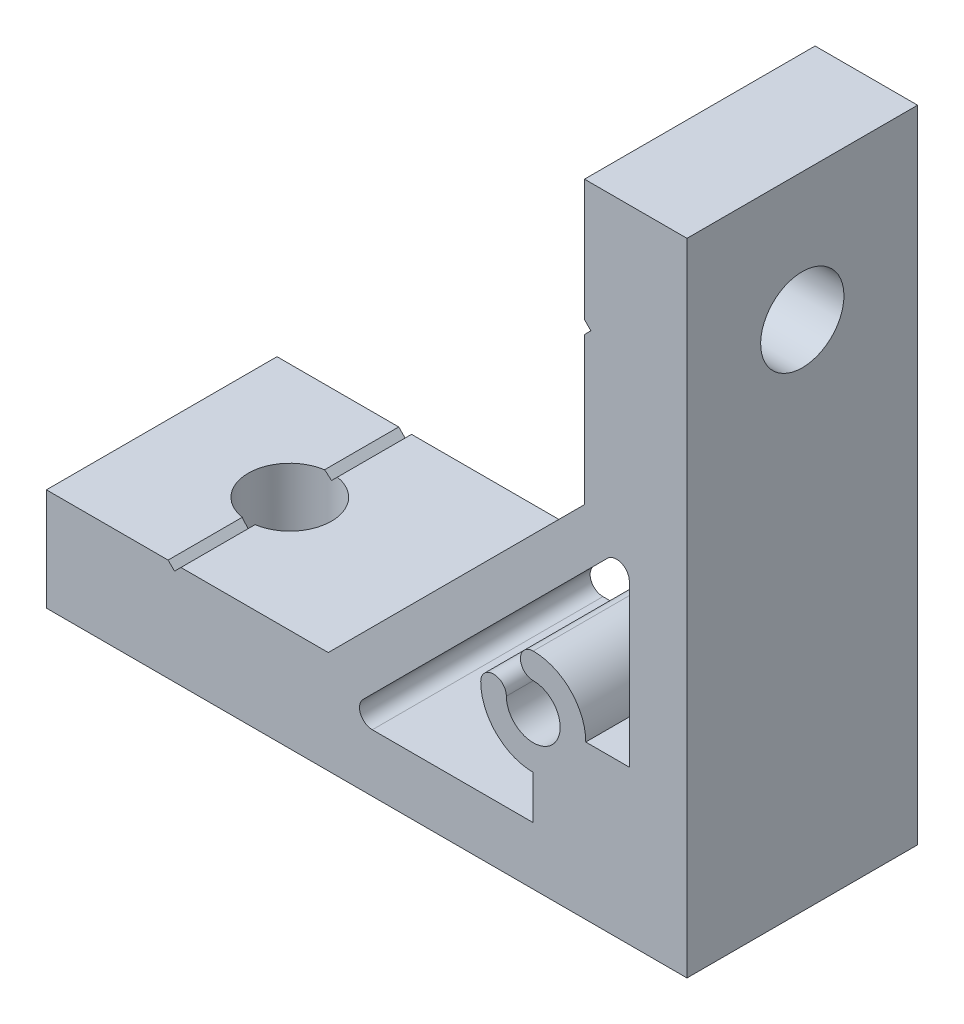
ISO-10303-21;
HEADER;
FILE_DESCRIPTION(('STEP AP214'),'2;1');
FILE_NAME('part.step','',(''),(''),'','','');
FILE_SCHEMA(('AUTOMOTIVE_DESIGN { 1 0 10303 214 1 1 1 1 }'));
ENDSEC;
DATA;
#1=APPLICATION_CONTEXT('core data for automotive mechanical design processes');
#2=APPLICATION_PROTOCOL_DEFINITION('international standard','automotive_design',2000,#1);
#3=PRODUCT_CONTEXT('',#1,'mechanical');
#4=PRODUCT('Part','Part','',(#3));
#5=PRODUCT_RELATED_PRODUCT_CATEGORY('part','',(#4));
#6=PRODUCT_DEFINITION_FORMATION('','',#4);
#7=PRODUCT_DEFINITION_CONTEXT('part definition',#1,'design');
#8=PRODUCT_DEFINITION('design','',#6,#7);
#9=PRODUCT_DEFINITION_SHAPE('','',#8);
#10=(LENGTH_UNIT() NAMED_UNIT(*) SI_UNIT(.MILLI.,.METRE.));
#11=(NAMED_UNIT(*) PLANE_ANGLE_UNIT() SI_UNIT($,.RADIAN.));
#12=(NAMED_UNIT(*) SI_UNIT($,.STERADIAN.) SOLID_ANGLE_UNIT());
#13=UNCERTAINTY_MEASURE_WITH_UNIT(LENGTH_MEASURE(1.E-05),#10,'distance_accuracy_value','');
#14=(GEOMETRIC_REPRESENTATION_CONTEXT(3) GLOBAL_UNCERTAINTY_ASSIGNED_CONTEXT((#13)) GLOBAL_UNIT_ASSIGNED_CONTEXT((#10,
#11,#12)) REPRESENTATION_CONTEXT('',''));
#15=CARTESIAN_POINT('',(0.,0.,0.));
#16=DIRECTION('',(0.,0.,1.));
#17=DIRECTION('',(1.,0.,0.));
#18=AXIS2_PLACEMENT_3D('',#15,#16,#17);
#19=CARTESIAN_POINT('',(-39.5,8.00000000000008,9.));
#20=DIRECTION('',(0.707106781186547,-0.707106781186547,0.));
#21=DIRECTION('',(0.707106781186548,0.707106781186548,0.));
#22=AXIS2_PLACEMENT_3D('',#19,#20,#21);
#23=PLANE('',#22);
#24=DIRECTION('',(0.,0.,-1.));
#25=VECTOR('',#24,1.);
#26=CARTESIAN_POINT('',(-39.5,8.00000000000008,9.));
#27=LINE('',#26,#25);
#28=CARTESIAN_POINT('',(-39.5,8.00000000000008,9.));
#29=VERTEX_POINT('',#28);
#30=CARTESIAN_POINT('',(-39.5,8.00000000000009,3.21130814466628));
#31=VERTEX_POINT('',#30);
#32=EDGE_CURVE('E264',#29,#31,#27,.T.);
#33=ORIENTED_EDGE('',*,*,#32,.T.);
#34=CARTESIAN_POINT('',(-40.,7.50000000000008,0.));
#35=DIRECTION('',(0.707106781186547,-0.707106781186547,0.));
#36=DIRECTION('',(0.707106781186548,0.707106781186548,0.));
#37=AXIS2_PLACEMENT_3D('',#34,#35,#36);
#38=ELLIPSE('',#37,4.59619407771252,3.25);
#39=CARTESIAN_POINT('',(-40.,7.50000000000008,3.25));
#40=VERTEX_POINT('',#39);
#41=EDGE_CURVE('E249',#31,#40,#38,.T.);
#42=ORIENTED_EDGE('',*,*,#41,.T.);
#43=DIRECTION('',(0.,0.,-1.));
#44=VECTOR('',#43,1.);
#45=CARTESIAN_POINT('',(-40.,7.50000000000008,9.));
#46=LINE('',#45,#44);
#47=CARTESIAN_POINT('',(-40.,7.50000000000008,9.));
#48=VERTEX_POINT('',#47);
#49=EDGE_CURVE('E248',#48,#40,#46,.T.);
#50=ORIENTED_EDGE('',*,*,#49,.F.);
#51=DIRECTION('',(-0.707106781186547,-0.707106781186547,0.));
#52=VECTOR('',#51,1.);
#53=CARTESIAN_POINT('',(-39.5,8.00000000000008,9.));
#54=LINE('',#53,#52);
#55=EDGE_CURVE('E365',#29,#48,#54,.T.);
#56=ORIENTED_EDGE('',*,*,#55,.F.);
#57=EDGE_LOOP('',(#33,#42,#50,#56));
#58=FACE_BOUND('',#57,.T.);
#59=ADVANCED_FACE('F34',(#58),#23,.F.);
#60=CARTESIAN_POINT('',(-40.,7.50000000000008,9.));
#61=DIRECTION('',(-0.707106781186549,-0.707106781186546,0.));
#62=DIRECTION('',(0.707106781186546,-0.707106781186549,0.));
#63=AXIS2_PLACEMENT_3D('',#60,#61,#62);
#64=PLANE('',#63);
#65=DIRECTION('',(0.,0.,-1.));
#66=VECTOR('',#65,1.);
#67=CARTESIAN_POINT('',(-40.5,8.00000000000008,9.));
#68=LINE('',#67,#66);
#69=CARTESIAN_POINT('',(-40.5,8.00000000000008,-3.21130814466628));
#70=VERTEX_POINT('',#69);
#71=CARTESIAN_POINT('',(-40.5,8.00000000000008,-9.));
#72=VERTEX_POINT('',#71);
#73=EDGE_CURVE('E256',#70,#72,#68,.T.);
#74=ORIENTED_EDGE('',*,*,#73,.F.);
#75=CARTESIAN_POINT('',(-40.,7.50000000000007,0.));
#76=DIRECTION('',(-0.707106781186549,-0.707106781186546,0.));
#77=DIRECTION('',(-0.707106781186546,0.707106781186549,0.));
#78=AXIS2_PLACEMENT_3D('',#75,#76,#77);
#79=ELLIPSE('',#78,4.59619407771261,3.25);
#80=CARTESIAN_POINT('',(-40.,7.50000000000008,-3.25));
#81=VERTEX_POINT('',#80);
#82=EDGE_CURVE('E49',#70,#81,#79,.T.);
#83=ORIENTED_EDGE('',*,*,#82,.T.);
#84=CARTESIAN_POINT('',(-40.,7.50000000000008,-9.));
#85=VERTEX_POINT('',#84);
#86=EDGE_CURVE('E255',#81,#85,#46,.T.);
#87=ORIENTED_EDGE('',*,*,#86,.T.);
#88=DIRECTION('',(-0.707106781186546,0.707106781186549,0.));
#89=VECTOR('',#88,1.);
#90=CARTESIAN_POINT('',(-40.,7.50000000000008,-9.));
#91=LINE('',#90,#89);
#92=EDGE_CURVE('E332',#85,#72,#91,.T.);
#93=ORIENTED_EDGE('',*,*,#92,.T.);
#94=EDGE_LOOP('',(#74,#83,#87,#93));
#95=FACE_BOUND('',#94,.T.);
#96=ADVANCED_FACE('F414',(#95),#64,.F.);
#97=CARTESIAN_POINT('',(-8.00000000000042,40.5,9.));
#98=DIRECTION('',(0.707106781186549,0.707106781186546,0.));
#99=DIRECTION('',(-0.707106781186546,0.707106781186549,0.));
#100=AXIS2_PLACEMENT_3D('',#97,#98,#99);
#101=PLANE('',#100);
#102=DIRECTION('',(0.,0.,-1.));
#103=VECTOR('',#102,1.);
#104=CARTESIAN_POINT('',(-8.00000000000042,40.5,9.));
#105=LINE('',#104,#103);
#106=CARTESIAN_POINT('',(-8.00000000000042,40.5,9.));
#107=VERTEX_POINT('',#106);
#108=CARTESIAN_POINT('',(-8.00000000000042,40.5,3.21130814466629));
#109=VERTEX_POINT('',#108);
#110=EDGE_CURVE('E282',#107,#109,#105,.T.);
#111=ORIENTED_EDGE('',*,*,#110,.T.);
#112=CARTESIAN_POINT('',(-7.50000000000042,40.,0.));
#113=DIRECTION('',(0.707106781186549,0.707106781186546,0.));
#114=DIRECTION('',(-0.707106781186546,0.707106781186549,0.));
#115=AXIS2_PLACEMENT_3D('',#112,#113,#114);
#116=ELLIPSE('',#115,4.59619407771271,3.25);
#117=CARTESIAN_POINT('',(-7.50000000000042,40.,3.25));
#118=VERTEX_POINT('',#117);
#119=EDGE_CURVE('E452',#109,#118,#116,.T.);
#120=ORIENTED_EDGE('',*,*,#119,.T.);
#121=DIRECTION('',(0.,0.,-1.));
#122=VECTOR('',#121,1.);
#123=CARTESIAN_POINT('',(-7.50000000000042,40.,9.));
#124=LINE('',#123,#122);
#125=CARTESIAN_POINT('',(-7.50000000000042,40.,9.));
#126=VERTEX_POINT('',#125);
#127=EDGE_CURVE('E278',#126,#118,#124,.T.);
#128=ORIENTED_EDGE('',*,*,#127,.F.);
#129=DIRECTION('',(0.707106781186546,-0.707106781186549,0.));
#130=VECTOR('',#129,1.);
#131=CARTESIAN_POINT('',(-8.00000000000042,40.5,9.));
#132=LINE('',#131,#130);
#133=EDGE_CURVE('E355',#107,#126,#132,.T.);
#134=ORIENTED_EDGE('',*,*,#133,.F.);
#135=EDGE_LOOP('',(#111,#120,#128,#134));
#136=FACE_BOUND('',#135,.T.);
#137=ADVANCED_FACE('F421',(#136),#101,.F.);
#138=CARTESIAN_POINT('',(-7.50000000000042,40.,9.));
#139=DIRECTION('',(0.707106781186549,-0.707106781186546,0.));
#140=DIRECTION('',(0.707106781186546,0.707106781186549,0.));
#141=AXIS2_PLACEMENT_3D('',#138,#139,#140);
#142=PLANE('',#141);
#143=DIRECTION('',(0.,0.,-1.));
#144=VECTOR('',#143,1.);
#145=CARTESIAN_POINT('',(-8.00000000000042,39.5,9.));
#146=LINE('',#145,#144);
#147=CARTESIAN_POINT('',(-8.00000000000042,39.5,-3.21130814466628));
#148=VERTEX_POINT('',#147);
#149=CARTESIAN_POINT('',(-8.00000000000042,39.5,-9.));
#150=VERTEX_POINT('',#149);
#151=EDGE_CURVE('E273',#148,#150,#146,.T.);
#152=ORIENTED_EDGE('',*,*,#151,.F.);
#153=CARTESIAN_POINT('',(-7.50000000000043,40.,0.));
#154=DIRECTION('',(0.707106781186549,-0.707106781186546,0.));
#155=DIRECTION('',(-0.707106781186546,-0.707106781186549,0.));
#156=AXIS2_PLACEMENT_3D('',#153,#154,#155);
#157=ELLIPSE('',#156,4.59619407771239,3.25);
#158=CARTESIAN_POINT('',(-7.50000000000042,40.,-3.25));
#159=VERTEX_POINT('',#158);
#160=EDGE_CURVE('E56',#148,#159,#157,.T.);
#161=ORIENTED_EDGE('',*,*,#160,.T.);
#162=CARTESIAN_POINT('',(-7.50000000000042,40.,-9.));
#163=VERTEX_POINT('',#162);
#164=EDGE_CURVE('E277',#159,#163,#124,.T.);
#165=ORIENTED_EDGE('',*,*,#164,.T.);
#166=DIRECTION('',(-0.707106781186546,-0.707106781186549,0.));
#167=VECTOR('',#166,1.);
#168=CARTESIAN_POINT('',(-7.50000000000042,40.,-9.));
#169=LINE('',#168,#167);
#170=EDGE_CURVE('E307',#163,#150,#169,.T.);
#171=ORIENTED_EDGE('',*,*,#170,.T.);
#172=EDGE_LOOP('',(#152,#161,#165,#171));
#173=FACE_BOUND('',#172,.T.);
#174=ADVANCED_FACE('F304',(#173),#142,.F.);
#175=CARTESIAN_POINT('',(0.,0.,9.));
#176=DIRECTION('',(0.,0.,1.));
#177=DIRECTION('',(1.,0.,0.));
#178=AXIS2_PLACEMENT_3D('',#175,#176,#177);
#179=PLANE('',#178);
#180=DIRECTION('',(0.,-1.,0.));
#181=VECTOR('',#180,1.);
#182=CARTESIAN_POINT('',(-50.,8.,9.));
#183=LINE('',#182,#181);
#184=CARTESIAN_POINT('',(-50.,8.,9.));
#185=VERTEX_POINT('',#184);
#186=CARTESIAN_POINT('',(-50.,0.,9.));
#187=VERTEX_POINT('',#186);
#188=EDGE_CURVE('E335',#185,#187,#183,.T.);
#189=ORIENTED_EDGE('',*,*,#188,.T.);
#190=DIRECTION('',(1.,0.,0.));
#191=VECTOR('',#190,1.);
#192=CARTESIAN_POINT('',(-50.,0.,9.));
#193=LINE('',#192,#191);
#194=CARTESIAN_POINT('',(0.,0.,9.));
#195=VERTEX_POINT('',#194);
#196=EDGE_CURVE('E339',#187,#195,#193,.T.);
#197=ORIENTED_EDGE('',*,*,#196,.T.);
#198=DIRECTION('',(0.,1.,0.));
#199=VECTOR('',#198,1.);
#200=CARTESIAN_POINT('',(0.,0.,9.));
#201=LINE('',#200,#199);
#202=CARTESIAN_POINT('',(0.,50.,9.));
#203=VERTEX_POINT('',#202);
#204=EDGE_CURVE('E344',#195,#203,#201,.T.);
#205=ORIENTED_EDGE('',*,*,#204,.T.);
#206=DIRECTION('',(-1.,0.,0.));
#207=VECTOR('',#206,1.);
#208=CARTESIAN_POINT('',(0.,50.,9.));
#209=LINE('',#208,#207);
#210=CARTESIAN_POINT('',(-8.00000000000009,50.,9.));
#211=VERTEX_POINT('',#210);
#212=EDGE_CURVE('E351',#203,#211,#209,.T.);
#213=ORIENTED_EDGE('',*,*,#212,.T.);
#214=DIRECTION('',(0.,-1.,0.));
#215=VECTOR('',#214,1.);
#216=CARTESIAN_POINT('',(-8.00000000000009,50.,9.));
#217=LINE('',#216,#215);
#218=EDGE_CURVE('E353',#211,#107,#217,.T.);
#219=ORIENTED_EDGE('',*,*,#218,.T.);
#220=ORIENTED_EDGE('',*,*,#133,.T.);
#221=DIRECTION('',(-0.707106781186546,-0.707106781186549,0.));
#222=VECTOR('',#221,1.);
#223=CARTESIAN_POINT('',(-7.50000000000042,40.,9.));
#224=LINE('',#223,#222);
#225=CARTESIAN_POINT('',(-8.00000000000042,39.5,9.));
#226=VERTEX_POINT('',#225);
#227=EDGE_CURVE('E357',#126,#226,#224,.T.);
#228=ORIENTED_EDGE('',*,*,#227,.T.);
#229=DIRECTION('',(0.,-1.,0.));
#230=VECTOR('',#229,1.);
#231=CARTESIAN_POINT('',(-8.00000000000042,39.5,9.));
#232=LINE('',#231,#230);
#233=CARTESIAN_POINT('',(-8.00000000000017,28.,9.));
#234=VERTEX_POINT('',#233);
#235=EDGE_CURVE('E359',#226,#234,#232,.T.);
#236=ORIENTED_EDGE('',*,*,#235,.T.);
#237=DIRECTION('',(-0.707106781186546,-0.707106781186549,0.));
#238=VECTOR('',#237,1.);
#239=CARTESIAN_POINT('',(-8.00000000000017,28.,9.));
#240=LINE('',#239,#238);
#241=CARTESIAN_POINT('',(-28.,8.00000000000008,9.));
#242=VERTEX_POINT('',#241);
#243=EDGE_CURVE('E361',#234,#242,#240,.T.);
#244=ORIENTED_EDGE('',*,*,#243,.T.);
#245=DIRECTION('',(-1.,0.,0.));
#246=VECTOR('',#245,1.);
#247=CARTESIAN_POINT('',(-28.,8.00000000000008,9.));
#248=LINE('',#247,#246);
#249=EDGE_CURVE('E363',#242,#29,#248,.T.);
#250=ORIENTED_EDGE('',*,*,#249,.T.);
#251=ORIENTED_EDGE('',*,*,#55,.T.);
#252=DIRECTION('',(-0.707106781186546,0.707106781186549,0.));
#253=VECTOR('',#252,1.);
#254=CARTESIAN_POINT('',(-40.,7.50000000000008,9.));
#255=LINE('',#254,#253);
#256=CARTESIAN_POINT('',(-40.5,8.00000000000008,9.));
#257=VERTEX_POINT('',#256);
#258=EDGE_CURVE('E367',#48,#257,#255,.T.);
#259=ORIENTED_EDGE('',*,*,#258,.T.);
#260=DIRECTION('',(-1.,0.,0.));
#261=VECTOR('',#260,1.);
#262=CARTESIAN_POINT('',(-40.5,8.00000000000008,9.));
#263=LINE('',#262,#261);
#264=EDGE_CURVE('E254',#257,#185,#263,.T.);
#265=ORIENTED_EDGE('',*,*,#264,.T.);
#266=EDGE_LOOP('',(#189,#197,#205,#213,#219,#220,#228,#236,#244,#250,#251,#259,#265));
#267=FACE_BOUND('',#266,.T.);
#268=DIRECTION('',(0.,1.,0.));
#269=VECTOR('',#268,1.);
#270=CARTESIAN_POINT('',(-4.5,12.,9.));
#271=LINE('',#270,#269);
#272=CARTESIAN_POINT('',(-4.5,12.,9.));
#273=VERTEX_POINT('',#272);
#274=CARTESIAN_POINT('',(-4.5,24.5603030380332,9.));
#275=VERTEX_POINT('',#274);
#276=EDGE_CURVE('E458',#273,#275,#271,.T.);
#277=ORIENTED_EDGE('',*,*,#276,.F.);
#278=DIRECTION('',(1.,0.,0.));
#279=VECTOR('',#278,1.);
#280=CARTESIAN_POINT('',(-7.9,12.,9.));
#281=LINE('',#280,#279);
#282=CARTESIAN_POINT('',(-7.9,12.,9.));
#283=VERTEX_POINT('',#282);
#284=EDGE_CURVE('E456',#283,#273,#281,.T.);
#285=ORIENTED_EDGE('',*,*,#284,.F.);
#286=CARTESIAN_POINT('',(-12.,12.,9.));
#287=DIRECTION('',(0.,0.,-1.));
#288=DIRECTION('',(-1.,0.,0.));
#289=AXIS2_PLACEMENT_3D('',#286,#287,#288);
#290=CIRCLE('',#289,4.1);
#291=CARTESIAN_POINT('',(-12.,16.1,9.));
#292=VERTEX_POINT('',#291);
#293=EDGE_CURVE('E480',#292,#283,#290,.T.);
#294=ORIENTED_EDGE('',*,*,#293,.F.);
#295=CARTESIAN_POINT('',(-12.,15.1,9.));
#296=DIRECTION('',(0.,0.,-1.));
#297=DIRECTION('',(-1.,0.,0.));
#298=AXIS2_PLACEMENT_3D('',#295,#296,#297);
#299=CIRCLE('',#298,1.);
#300=CARTESIAN_POINT('',(-12.,14.1,9.));
#301=VERTEX_POINT('',#300);
#302=EDGE_CURVE('E477',#301,#292,#299,.T.);
#303=ORIENTED_EDGE('',*,*,#302,.F.);
#304=CARTESIAN_POINT('',(-12.,12.,9.));
#305=DIRECTION('',(0.,0.,1.));
#306=DIRECTION('',(1.,0.,0.));
#307=AXIS2_PLACEMENT_3D('',#304,#305,#306);
#308=CIRCLE('',#307,2.1);
#309=CARTESIAN_POINT('',(-14.1,12.,9.));
#310=VERTEX_POINT('',#309);
#311=EDGE_CURVE('E475',#310,#301,#308,.T.);
#312=ORIENTED_EDGE('',*,*,#311,.F.);
#313=CARTESIAN_POINT('',(-15.1,12.,9.));
#314=DIRECTION('',(0.,0.,-1.));
#315=DIRECTION('',(-1.,0.,0.));
#316=AXIS2_PLACEMENT_3D('',#313,#314,#315);
#317=CIRCLE('',#316,1.);
#318=CARTESIAN_POINT('',(-16.1,12.,9.));
#319=VERTEX_POINT('',#318);
#320=EDGE_CURVE('E473',#319,#310,#317,.T.);
#321=ORIENTED_EDGE('',*,*,#320,.F.);
#322=CARTESIAN_POINT('',(-12.,12.,9.));
#323=DIRECTION('',(0.,0.,-1.));
#324=DIRECTION('',(-1.,0.,0.));
#325=AXIS2_PLACEMENT_3D('',#322,#323,#324);
#326=CIRCLE('',#325,4.1);
#327=CARTESIAN_POINT('',(-12.,7.9,9.));
#328=VERTEX_POINT('',#327);
#329=EDGE_CURVE('E471',#328,#319,#326,.T.);
#330=ORIENTED_EDGE('',*,*,#329,.F.);
#331=DIRECTION('',(0.,1.,0.));
#332=VECTOR('',#331,1.);
#333=CARTESIAN_POINT('',(-12.,4.5,9.));
#334=LINE('',#333,#332);
#335=CARTESIAN_POINT('',(-12.,4.5,9.));
#336=VERTEX_POINT('',#335);
#337=EDGE_CURVE('E469',#336,#328,#334,.T.);
#338=ORIENTED_EDGE('',*,*,#337,.F.);
#339=DIRECTION('',(1.,0.,0.));
#340=VECTOR('',#339,1.);
#341=CARTESIAN_POINT('',(-24.5603030380331,4.5,9.));
#342=LINE('',#341,#340);
#343=CARTESIAN_POINT('',(-24.5603030380331,4.5,9.));
#344=VERTEX_POINT('',#343);
#345=EDGE_CURVE('E467',#344,#336,#342,.T.);
#346=ORIENTED_EDGE('',*,*,#345,.F.);
#347=CARTESIAN_POINT('',(-24.5603030380331,5.5,9.));
#348=DIRECTION('',(0.,0.,1.));
#349=DIRECTION('',(1.,0.,0.));
#350=AXIS2_PLACEMENT_3D('',#347,#348,#349);
#351=CIRCLE('',#350,1.);
#352=CARTESIAN_POINT('',(-25.2674098192196,6.20710678118655,9.));
#353=VERTEX_POINT('',#352);
#354=EDGE_CURVE('E465',#353,#344,#351,.T.);
#355=ORIENTED_EDGE('',*,*,#354,.F.);
#356=DIRECTION('',(-0.707106781186546,-0.707106781186549,0.));
#357=VECTOR('',#356,1.);
#358=CARTESIAN_POINT('',(-6.20710678118655,25.2674098192197,9.));
#359=LINE('',#358,#357);
#360=CARTESIAN_POINT('',(-6.20710678118655,25.2674098192197,9.));
#361=VERTEX_POINT('',#360);
#362=EDGE_CURVE('E463',#361,#353,#359,.T.);
#363=ORIENTED_EDGE('',*,*,#362,.F.);
#364=CARTESIAN_POINT('',(-5.5,24.5603030380332,9.));
#365=DIRECTION('',(0.,0.,1.));
#366=DIRECTION('',(1.,0.,0.));
#367=AXIS2_PLACEMENT_3D('',#364,#365,#366);
#368=CIRCLE('',#367,0.999999999999999);
#369=EDGE_CURVE('E461',#275,#361,#368,.T.);
#370=ORIENTED_EDGE('',*,*,#369,.F.);
#371=EDGE_LOOP('',(#277,#285,#294,#303,#312,#321,#330,#338,#346,#355,#363,#370));
#372=FACE_BOUND('',#371,.T.);
#373=ADVANCED_FACE('F411',(#267,#372),#179,.T.);
#374=CARTESIAN_POINT('',(0.,0.,-9.));
#375=DIRECTION('',(0.,0.,1.));
#376=DIRECTION('',(1.,0.,0.));
#377=AXIS2_PLACEMENT_3D('',#374,#375,#376);
#378=PLANE('',#377);
#379=DIRECTION('',(0.,-1.,0.));
#380=VECTOR('',#379,1.);
#381=CARTESIAN_POINT('',(-50.,8.,-9.));
#382=LINE('',#381,#380);
#383=CARTESIAN_POINT('',(-50.,8.,-9.));
#384=VERTEX_POINT('',#383);
#385=CARTESIAN_POINT('',(-50.,0.,-9.));
#386=VERTEX_POINT('',#385);
#387=EDGE_CURVE('E370',#384,#386,#382,.T.);
#388=ORIENTED_EDGE('',*,*,#387,.F.);
#389=DIRECTION('',(-1.,0.,0.));
#390=VECTOR('',#389,1.);
#391=CARTESIAN_POINT('',(-40.5,8.00000000000008,-9.));
#392=LINE('',#391,#390);
#393=EDGE_CURVE('E334',#72,#384,#392,.T.);
#394=ORIENTED_EDGE('',*,*,#393,.F.);
#395=ORIENTED_EDGE('',*,*,#92,.F.);
#396=DIRECTION('',(-0.707106781186547,-0.707106781186547,0.));
#397=VECTOR('',#396,1.);
#398=CARTESIAN_POINT('',(-39.5,8.00000000000008,-9.));
#399=LINE('',#398,#397);
#400=CARTESIAN_POINT('',(-39.5,8.00000000000008,-9.));
#401=VERTEX_POINT('',#400);
#402=EDGE_CURVE('E329',#401,#85,#399,.T.);
#403=ORIENTED_EDGE('',*,*,#402,.F.);
#404=DIRECTION('',(-1.,0.,0.));
#405=VECTOR('',#404,1.);
#406=CARTESIAN_POINT('',(-28.,8.00000000000008,-9.));
#407=LINE('',#406,#405);
#408=CARTESIAN_POINT('',(-28.,8.00000000000008,-9.));
#409=VERTEX_POINT('',#408);
#410=EDGE_CURVE('E323',#409,#401,#407,.T.);
#411=ORIENTED_EDGE('',*,*,#410,.F.);
#412=DIRECTION('',(-0.707106781186546,-0.707106781186549,0.));
#413=VECTOR('',#412,1.);
#414=CARTESIAN_POINT('',(-8.00000000000017,28.,-9.));
#415=LINE('',#414,#413);
#416=CARTESIAN_POINT('',(-8.00000000000017,28.,-9.));
#417=VERTEX_POINT('',#416);
#418=EDGE_CURVE('E320',#417,#409,#415,.T.);
#419=ORIENTED_EDGE('',*,*,#418,.F.);
#420=DIRECTION('',(0.,-1.,0.));
#421=VECTOR('',#420,1.);
#422=CARTESIAN_POINT('',(-8.00000000000042,39.5,-9.));
#423=LINE('',#422,#421);
#424=EDGE_CURVE('E312',#150,#417,#423,.T.);
#425=ORIENTED_EDGE('',*,*,#424,.F.);
#426=ORIENTED_EDGE('',*,*,#170,.F.);
#427=DIRECTION('',(0.707106781186546,-0.707106781186549,0.));
#428=VECTOR('',#427,1.);
#429=CARTESIAN_POINT('',(-8.00000000000042,40.5,-9.));
#430=LINE('',#429,#428);
#431=CARTESIAN_POINT('',(-8.00000000000042,40.5,-9.));
#432=VERTEX_POINT('',#431);
#433=EDGE_CURVE('E313',#432,#163,#430,.T.);
#434=ORIENTED_EDGE('',*,*,#433,.F.);
#435=DIRECTION('',(0.,-1.,0.));
#436=VECTOR('',#435,1.);
#437=CARTESIAN_POINT('',(-8.00000000000009,50.,-9.));
#438=LINE('',#437,#436);
#439=CARTESIAN_POINT('',(-8.00000000000009,50.,-9.));
#440=VERTEX_POINT('',#439);
#441=EDGE_CURVE('E379',#440,#432,#438,.T.);
#442=ORIENTED_EDGE('',*,*,#441,.F.);
#443=DIRECTION('',(-1.,0.,0.));
#444=VECTOR('',#443,1.);
#445=CARTESIAN_POINT('',(0.,50.,-9.));
#446=LINE('',#445,#444);
#447=CARTESIAN_POINT('',(0.,50.,-9.));
#448=VERTEX_POINT('',#447);
#449=EDGE_CURVE('E377',#448,#440,#446,.T.);
#450=ORIENTED_EDGE('',*,*,#449,.F.);
#451=DIRECTION('',(0.,1.,0.));
#452=VECTOR('',#451,1.);
#453=CARTESIAN_POINT('',(0.,0.,-9.));
#454=LINE('',#453,#452);
#455=CARTESIAN_POINT('',(0.,0.,-9.));
#456=VERTEX_POINT('',#455);
#457=EDGE_CURVE('E375',#456,#448,#454,.T.);
#458=ORIENTED_EDGE('',*,*,#457,.F.);
#459=DIRECTION('',(1.,0.,0.));
#460=VECTOR('',#459,1.);
#461=CARTESIAN_POINT('',(-50.,0.,-9.));
#462=LINE('',#461,#460);
#463=EDGE_CURVE('E373',#386,#456,#462,.T.);
#464=ORIENTED_EDGE('',*,*,#463,.F.);
#465=EDGE_LOOP('',(#388,#394,#395,#403,#411,#419,#425,#426,#434,#442,#450,#458,#464));
#466=FACE_BOUND('',#465,.T.);
#467=DIRECTION('',(1.,0.,0.));
#468=VECTOR('',#467,1.);
#469=CARTESIAN_POINT('',(-7.9,12.,-9.));
#470=LINE('',#469,#468);
#471=CARTESIAN_POINT('',(-7.9,12.,-9.));
#472=VERTEX_POINT('',#471);
#473=CARTESIAN_POINT('',(-4.5,12.,-9.));
#474=VERTEX_POINT('',#473);
#475=EDGE_CURVE('E483',#472,#474,#470,.T.);
#476=ORIENTED_EDGE('',*,*,#475,.T.);
#477=DIRECTION('',(0.,1.,0.));
#478=VECTOR('',#477,1.);
#479=CARTESIAN_POINT('',(-4.5,12.,-9.));
#480=LINE('',#479,#478);
#481=CARTESIAN_POINT('',(-4.5,24.5603030380332,-9.));
#482=VERTEX_POINT('',#481);
#483=EDGE_CURVE('E486',#474,#482,#480,.T.);
#484=ORIENTED_EDGE('',*,*,#483,.T.);
#485=CARTESIAN_POINT('',(-5.5,24.5603030380332,-9.));
#486=DIRECTION('',(0.,0.,1.));
#487=DIRECTION('',(1.,0.,0.));
#488=AXIS2_PLACEMENT_3D('',#485,#486,#487);
#489=CIRCLE('',#488,0.999999999999999);
#490=CARTESIAN_POINT('',(-6.20710678118655,25.2674098192197,-9.));
#491=VERTEX_POINT('',#490);
#492=EDGE_CURVE('E489',#482,#491,#489,.T.);
#493=ORIENTED_EDGE('',*,*,#492,.T.);
#494=DIRECTION('',(-0.707106781186546,-0.707106781186549,0.));
#495=VECTOR('',#494,1.);
#496=CARTESIAN_POINT('',(-6.20710678118655,25.2674098192197,-9.));
#497=LINE('',#496,#495);
#498=CARTESIAN_POINT('',(-25.2674098192196,6.20710678118655,-9.));
#499=VERTEX_POINT('',#498);
#500=EDGE_CURVE('E492',#491,#499,#497,.T.);
#501=ORIENTED_EDGE('',*,*,#500,.T.);
#502=CARTESIAN_POINT('',(-24.5603030380331,5.5,-9.));
#503=DIRECTION('',(0.,0.,1.));
#504=DIRECTION('',(1.,0.,0.));
#505=AXIS2_PLACEMENT_3D('',#502,#503,#504);
#506=CIRCLE('',#505,1.);
#507=CARTESIAN_POINT('',(-24.5603030380331,4.5,-9.));
#508=VERTEX_POINT('',#507);
#509=EDGE_CURVE('E495',#499,#508,#506,.T.);
#510=ORIENTED_EDGE('',*,*,#509,.T.);
#511=DIRECTION('',(1.,0.,0.));
#512=VECTOR('',#511,1.);
#513=CARTESIAN_POINT('',(-24.5603030380331,4.5,-9.));
#514=LINE('',#513,#512);
#515=CARTESIAN_POINT('',(-12.,4.5,-9.));
#516=VERTEX_POINT('',#515);
#517=EDGE_CURVE('E498',#508,#516,#514,.T.);
#518=ORIENTED_EDGE('',*,*,#517,.T.);
#519=DIRECTION('',(0.,1.,0.));
#520=VECTOR('',#519,1.);
#521=CARTESIAN_POINT('',(-12.,4.5,-9.));
#522=LINE('',#521,#520);
#523=CARTESIAN_POINT('',(-12.,7.9,-9.));
#524=VERTEX_POINT('',#523);
#525=EDGE_CURVE('E501',#516,#524,#522,.T.);
#526=ORIENTED_EDGE('',*,*,#525,.T.);
#527=CARTESIAN_POINT('',(-12.,12.,-9.));
#528=DIRECTION('',(0.,0.,-1.));
#529=DIRECTION('',(-1.,0.,0.));
#530=AXIS2_PLACEMENT_3D('',#527,#528,#529);
#531=CIRCLE('',#530,4.1);
#532=CARTESIAN_POINT('',(-16.1,12.,-9.));
#533=VERTEX_POINT('',#532);
#534=EDGE_CURVE('E504',#524,#533,#531,.T.);
#535=ORIENTED_EDGE('',*,*,#534,.T.);
#536=CARTESIAN_POINT('',(-15.1,12.,-9.));
#537=DIRECTION('',(0.,0.,-1.));
#538=DIRECTION('',(-1.,0.,0.));
#539=AXIS2_PLACEMENT_3D('',#536,#537,#538);
#540=CIRCLE('',#539,1.);
#541=CARTESIAN_POINT('',(-14.1,12.,-9.));
#542=VERTEX_POINT('',#541);
#543=EDGE_CURVE('E507',#533,#542,#540,.T.);
#544=ORIENTED_EDGE('',*,*,#543,.T.);
#545=CARTESIAN_POINT('',(-12.,12.,-9.));
#546=DIRECTION('',(0.,0.,1.));
#547=DIRECTION('',(1.,0.,0.));
#548=AXIS2_PLACEMENT_3D('',#545,#546,#547);
#549=CIRCLE('',#548,2.1);
#550=CARTESIAN_POINT('',(-12.,14.1,-9.));
#551=VERTEX_POINT('',#550);
#552=EDGE_CURVE('E510',#542,#551,#549,.T.);
#553=ORIENTED_EDGE('',*,*,#552,.T.);
#554=CARTESIAN_POINT('',(-12.,15.1,-9.));
#555=DIRECTION('',(0.,0.,-1.));
#556=DIRECTION('',(-1.,0.,0.));
#557=AXIS2_PLACEMENT_3D('',#554,#555,#556);
#558=CIRCLE('',#557,1.);
#559=CARTESIAN_POINT('',(-12.,16.1,-9.));
#560=VERTEX_POINT('',#559);
#561=EDGE_CURVE('E513',#551,#560,#558,.T.);
#562=ORIENTED_EDGE('',*,*,#561,.T.);
#563=CARTESIAN_POINT('',(-12.,12.,-9.));
#564=DIRECTION('',(0.,0.,-1.));
#565=DIRECTION('',(-1.,0.,0.));
#566=AXIS2_PLACEMENT_3D('',#563,#564,#565);
#567=CIRCLE('',#566,4.1);
#568=EDGE_CURVE('E459',#560,#472,#567,.T.);
#569=ORIENTED_EDGE('',*,*,#568,.T.);
#570=EDGE_LOOP('',(#476,#484,#493,#501,#510,#518,#526,#535,#544,#553,#562,#569));
#571=FACE_BOUND('',#570,.T.);
#572=ADVANCED_FACE('F317',(#466,#571),#378,.F.);
#573=CARTESIAN_POINT('',(-50.,8.,9.));
#574=DIRECTION('',(1.,0.,0.));
#575=DIRECTION('',(0.,1.,0.));
#576=AXIS2_PLACEMENT_3D('',#573,#574,#575);
#577=PLANE('',#576);
#578=ORIENTED_EDGE('',*,*,#387,.T.);
#579=DIRECTION('',(0.,0.,-1.));
#580=VECTOR('',#579,1.);
#581=CARTESIAN_POINT('',(-50.,0.,9.));
#582=LINE('',#581,#580);
#583=EDGE_CURVE('E294',#187,#386,#582,.T.);
#584=ORIENTED_EDGE('',*,*,#583,.F.);
#585=ORIENTED_EDGE('',*,*,#188,.F.);
#586=DIRECTION('',(0.,0.,-1.));
#587=VECTOR('',#586,1.);
#588=CARTESIAN_POINT('',(-50.,8.,9.));
#589=LINE('',#588,#587);
#590=EDGE_CURVE('E259',#185,#384,#589,.T.);
#591=ORIENTED_EDGE('',*,*,#590,.T.);
#592=EDGE_LOOP('',(#578,#584,#585,#591));
#593=FACE_BOUND('',#592,.T.);
#594=ADVANCED_FACE('F36',(#593),#577,.F.);
#595=CARTESIAN_POINT('',(-50.,0.,9.));
#596=DIRECTION('',(0.,1.,0.));
#597=DIRECTION('',(-1.,0.,0.));
#598=AXIS2_PLACEMENT_3D('',#595,#596,#597);
#599=PLANE('',#598);
#600=CARTESIAN_POINT('',(-40.,-3.29597460435593E-13,0.));
#601=DIRECTION('',(0.,1.,0.));
#602=DIRECTION('',(-1.,0.,0.));
#603=AXIS2_PLACEMENT_3D('',#600,#601,#602);
#604=CIRCLE('',#603,3.25);
#605=CARTESIAN_POINT('',(-43.25,-3.56303071842079E-13,0.));
#606=VERTEX_POINT('',#605);
#607=EDGE_CURVE('E250',#606,#606,#604,.T.);
#608=ORIENTED_EDGE('',*,*,#607,.T.);
#609=EDGE_LOOP('',(#608));
#610=FACE_BOUND('',#609,.T.);
#611=ORIENTED_EDGE('',*,*,#463,.T.);
#612=DIRECTION('',(0.,0.,-1.));
#613=VECTOR('',#612,1.);
#614=CARTESIAN_POINT('',(0.,0.,9.));
#615=LINE('',#614,#613);
#616=EDGE_CURVE('E291',#195,#456,#615,.T.);
#617=ORIENTED_EDGE('',*,*,#616,.F.);
#618=ORIENTED_EDGE('',*,*,#196,.F.);
#619=ORIENTED_EDGE('',*,*,#583,.T.);
#620=EDGE_LOOP('',(#611,#617,#618,#619));
#621=FACE_BOUND('',#620,.T.);
#622=ADVANCED_FACE('F403',(#610,#621),#599,.F.);
#623=CARTESIAN_POINT('',(0.,0.,9.));
#624=DIRECTION('',(-1.,0.,0.));
#625=DIRECTION('',(0.,0.,1.));
#626=AXIS2_PLACEMENT_3D('',#623,#624,#625);
#627=PLANE('',#626);
#628=CARTESIAN_POINT('',(1.38777878078145E-12,39.9999999999998,0.));
#629=DIRECTION('',(-1.,0.,0.));
#630=DIRECTION('',(0.,-1.,0.));
#631=AXIS2_PLACEMENT_3D('',#628,#629,#630);
#632=CIRCLE('',#631,3.25);
#633=CARTESIAN_POINT('',(1.27502175484295E-12,36.7499999999998,0.));
#634=VERTEX_POINT('',#633);
#635=EDGE_CURVE('E446',#634,#634,#632,.T.);
#636=ORIENTED_EDGE('',*,*,#635,.T.);
#637=EDGE_LOOP('',(#636));
#638=FACE_BOUND('',#637,.T.);
#639=ORIENTED_EDGE('',*,*,#457,.T.);
#640=DIRECTION('',(0.,0.,-1.));
#641=VECTOR('',#640,1.);
#642=CARTESIAN_POINT('',(0.,50.,9.));
#643=LINE('',#642,#641);
#644=EDGE_CURVE('E288',#203,#448,#643,.T.);
#645=ORIENTED_EDGE('',*,*,#644,.F.);
#646=ORIENTED_EDGE('',*,*,#204,.F.);
#647=ORIENTED_EDGE('',*,*,#616,.T.);
#648=EDGE_LOOP('',(#639,#645,#646,#647));
#649=FACE_BOUND('',#648,.T.);
#650=ADVANCED_FACE('F400',(#638,#649),#627,.F.);
#651=CARTESIAN_POINT('',(0.,50.,9.));
#652=DIRECTION('',(0.,-1.,0.));
#653=DIRECTION('',(0.,0.,-1.));
#654=AXIS2_PLACEMENT_3D('',#651,#652,#653);
#655=PLANE('',#654);
#656=ORIENTED_EDGE('',*,*,#449,.T.);
#657=DIRECTION('',(0.,0.,-1.));
#658=VECTOR('',#657,1.);
#659=CARTESIAN_POINT('',(-8.00000000000009,50.,9.));
#660=LINE('',#659,#658);
#661=EDGE_CURVE('E285',#211,#440,#660,.T.);
#662=ORIENTED_EDGE('',*,*,#661,.F.);
#663=ORIENTED_EDGE('',*,*,#212,.F.);
#664=ORIENTED_EDGE('',*,*,#644,.T.);
#665=EDGE_LOOP('',(#656,#662,#663,#664));
#666=FACE_BOUND('',#665,.T.);
#667=ADVANCED_FACE('F396',(#666),#655,.F.);
#668=CARTESIAN_POINT('',(-8.00000000000009,50.,9.));
#669=DIRECTION('',(1.,0.,0.));
#670=DIRECTION('',(0.,1.,0.));
#671=AXIS2_PLACEMENT_3D('',#668,#669,#670);
#672=PLANE('',#671);
#673=CARTESIAN_POINT('',(-8.00000000000042,40.5,-3.21130814466629));
#674=VERTEX_POINT('',#673);
#675=EDGE_CURVE('E281',#674,#432,#105,.T.);
#676=ORIENTED_EDGE('',*,*,#675,.F.);
#677=CARTESIAN_POINT('',(-8.00000000000044,40.0000000000001,0.));
#678=DIRECTION('',(-1.,0.,0.));
#679=DIRECTION('',(0.,-1.,0.));
#680=AXIS2_PLACEMENT_3D('',#677,#678,#679);
#681=CIRCLE('',#680,3.25);
#682=EDGE_CURVE('E440',#109,#674,#681,.T.);
#683=ORIENTED_EDGE('',*,*,#682,.F.);
#684=ORIENTED_EDGE('',*,*,#110,.F.);
#685=ORIENTED_EDGE('',*,*,#218,.F.);
#686=ORIENTED_EDGE('',*,*,#661,.T.);
#687=ORIENTED_EDGE('',*,*,#441,.T.);
#688=EDGE_LOOP('',(#676,#683,#684,#685,#686,#687));
#689=FACE_BOUND('',#688,.T.);
#690=ADVANCED_FACE('F389',(#689),#672,.F.);
#691=ORIENTED_EDGE('',*,*,#164,.F.);
#692=EDGE_CURVE('E455',#159,#674,#116,.T.);
#693=ORIENTED_EDGE('',*,*,#692,.T.);
#694=ORIENTED_EDGE('',*,*,#675,.T.);
#695=ORIENTED_EDGE('',*,*,#433,.T.);
#696=EDGE_LOOP('',(#691,#693,#694,#695));
#697=FACE_BOUND('',#696,.T.);
#698=ADVANCED_FACE('F382',(#697),#101,.F.);
#699=ORIENTED_EDGE('',*,*,#127,.T.);
#700=CARTESIAN_POINT('',(-8.00000000000046,39.5,3.21130814466628));
#701=VERTEX_POINT('',#700);
#702=EDGE_CURVE('E449',#118,#701,#157,.T.);
#703=ORIENTED_EDGE('',*,*,#702,.T.);
#704=EDGE_CURVE('E274',#226,#701,#146,.T.);
#705=ORIENTED_EDGE('',*,*,#704,.F.);
#706=ORIENTED_EDGE('',*,*,#227,.F.);
#707=EDGE_LOOP('',(#699,#703,#705,#706));
#708=FACE_BOUND('',#707,.T.);
#709=ADVANCED_FACE('F706',(#708),#142,.F.);
#710=CARTESIAN_POINT('',(-8.00000000000042,39.5,9.));
#711=DIRECTION('',(1.,0.,0.));
#712=DIRECTION('',(0.,1.,0.));
#713=AXIS2_PLACEMENT_3D('',#710,#711,#712);
#714=PLANE('',#713);
#715=ORIENTED_EDGE('',*,*,#704,.T.);
#716=CARTESIAN_POINT('',(-8.00000000000043,40.0000000000001,0.));
#717=DIRECTION('',(1.,0.,0.));
#718=DIRECTION('',(0.,1.,0.));
#719=AXIS2_PLACEMENT_3D('',#716,#717,#718);
#720=CIRCLE('',#719,3.25);
#721=EDGE_CURVE('E42',#701,#148,#720,.T.);
#722=ORIENTED_EDGE('',*,*,#721,.T.);
#723=ORIENTED_EDGE('',*,*,#151,.T.);
#724=ORIENTED_EDGE('',*,*,#424,.T.);
#725=DIRECTION('',(0.,0.,-1.));
#726=VECTOR('',#725,1.);
#727=CARTESIAN_POINT('',(-8.00000000000017,28.,9.));
#728=LINE('',#727,#726);
#729=EDGE_CURVE('E270',#234,#417,#728,.T.);
#730=ORIENTED_EDGE('',*,*,#729,.F.);
#731=ORIENTED_EDGE('',*,*,#235,.F.);
#732=EDGE_LOOP('',(#715,#722,#723,#724,#730,#731));
#733=FACE_BOUND('',#732,.T.);
#734=ADVANCED_FACE('F298',(#733),#714,.F.);
#735=CARTESIAN_POINT('',(-8.00000000000017,28.,9.));
#736=DIRECTION('',(0.707106781186549,-0.707106781186546,0.));
#737=DIRECTION('',(0.707106781186546,0.707106781186549,0.));
#738=AXIS2_PLACEMENT_3D('',#735,#736,#737);
#739=PLANE('',#738);
#740=ORIENTED_EDGE('',*,*,#418,.T.);
#741=DIRECTION('',(0.,0.,-1.));
#742=VECTOR('',#741,1.);
#743=CARTESIAN_POINT('',(-28.,8.00000000000008,9.));
#744=LINE('',#743,#742);
#745=EDGE_CURVE('E267',#242,#409,#744,.T.);
#746=ORIENTED_EDGE('',*,*,#745,.F.);
#747=ORIENTED_EDGE('',*,*,#243,.F.);
#748=ORIENTED_EDGE('',*,*,#729,.T.);
#749=EDGE_LOOP('',(#740,#746,#747,#748));
#750=FACE_BOUND('',#749,.T.);
#751=ADVANCED_FACE('F432',(#750),#739,.F.);
#752=CARTESIAN_POINT('',(-28.,8.00000000000008,9.));
#753=DIRECTION('',(0.,-1.,0.));
#754=DIRECTION('',(1.,0.,0.));
#755=AXIS2_PLACEMENT_3D('',#752,#753,#754);
#756=PLANE('',#755);
#757=CARTESIAN_POINT('',(-39.5,8.00000000000009,-3.21130814466628));
#758=VERTEX_POINT('',#757);
#759=EDGE_CURVE('E263',#758,#401,#27,.T.);
#760=ORIENTED_EDGE('',*,*,#759,.F.);
#761=CARTESIAN_POINT('',(-40.,8.00000000000008,0.));
#762=DIRECTION('',(0.,1.,0.));
#763=DIRECTION('',(-1.,0.,0.));
#764=AXIS2_PLACEMENT_3D('',#761,#762,#763);
#765=CIRCLE('',#764,3.25);
#766=EDGE_CURVE('E443',#31,#758,#765,.T.);
#767=ORIENTED_EDGE('',*,*,#766,.F.);
#768=ORIENTED_EDGE('',*,*,#32,.F.);
#769=ORIENTED_EDGE('',*,*,#249,.F.);
#770=ORIENTED_EDGE('',*,*,#745,.T.);
#771=ORIENTED_EDGE('',*,*,#410,.T.);
#772=EDGE_LOOP('',(#760,#767,#768,#769,#770,#771));
#773=FACE_BOUND('',#772,.T.);
#774=ADVANCED_FACE('F426',(#773),#756,.F.);
#775=ORIENTED_EDGE('',*,*,#86,.F.);
#776=EDGE_CURVE('E436',#81,#758,#38,.T.);
#777=ORIENTED_EDGE('',*,*,#776,.T.);
#778=ORIENTED_EDGE('',*,*,#759,.T.);
#779=ORIENTED_EDGE('',*,*,#402,.T.);
#780=EDGE_LOOP('',(#775,#777,#778,#779));
#781=FACE_BOUND('',#780,.T.);
#782=ADVANCED_FACE('F417',(#781),#23,.F.);
#783=ORIENTED_EDGE('',*,*,#49,.T.);
#784=CARTESIAN_POINT('',(-40.5,8.00000000000008,3.21130814466628));
#785=VERTEX_POINT('',#784);
#786=EDGE_CURVE('E235',#40,#785,#79,.T.);
#787=ORIENTED_EDGE('',*,*,#786,.T.);
#788=EDGE_CURVE('E245',#257,#785,#68,.T.);
#789=ORIENTED_EDGE('',*,*,#788,.F.);
#790=ORIENTED_EDGE('',*,*,#258,.F.);
#791=EDGE_LOOP('',(#783,#787,#789,#790));
#792=FACE_BOUND('',#791,.T.);
#793=ADVANCED_FACE('F243',(#792),#64,.F.);
#794=CARTESIAN_POINT('',(-40.5,8.00000000000008,9.));
#795=DIRECTION('',(0.,-1.,0.));
#796=DIRECTION('',(1.,0.,0.));
#797=AXIS2_PLACEMENT_3D('',#794,#795,#796);
#798=PLANE('',#797);
#799=ORIENTED_EDGE('',*,*,#788,.T.);
#800=CARTESIAN_POINT('',(-40.,8.00000000000008,0.));
#801=DIRECTION('',(0.,-1.,0.));
#802=DIRECTION('',(1.,0.,0.));
#803=AXIS2_PLACEMENT_3D('',#800,#801,#802);
#804=CIRCLE('',#803,3.25);
#805=EDGE_CURVE('E11',#785,#70,#804,.T.);
#806=ORIENTED_EDGE('',*,*,#805,.T.);
#807=ORIENTED_EDGE('',*,*,#73,.T.);
#808=ORIENTED_EDGE('',*,*,#393,.T.);
#809=ORIENTED_EDGE('',*,*,#590,.F.);
#810=ORIENTED_EDGE('',*,*,#264,.F.);
#811=EDGE_LOOP('',(#799,#806,#807,#808,#809,#810));
#812=FACE_BOUND('',#811,.T.);
#813=ADVANCED_FACE('F252',(#812),#798,.F.);
#814=CARTESIAN_POINT('',(-7.9,12.,9.));
#815=DIRECTION('',(0.,1.,0.));
#816=DIRECTION('',(0.,0.,1.));
#817=AXIS2_PLACEMENT_3D('',#814,#815,#816);
#818=PLANE('',#817);
#819=ORIENTED_EDGE('',*,*,#475,.F.);
#820=DIRECTION('',(0.,0.,-1.));
#821=VECTOR('',#820,1.);
#822=CARTESIAN_POINT('',(-7.9,12.,9.));
#823=LINE('',#822,#821);
#824=EDGE_CURVE('E482',#283,#472,#823,.T.);
#825=ORIENTED_EDGE('',*,*,#824,.F.);
#826=ORIENTED_EDGE('',*,*,#284,.T.);
#827=DIRECTION('',(0.,0.,-1.));
#828=VECTOR('',#827,1.);
#829=CARTESIAN_POINT('',(-4.5,12.,9.));
#830=LINE('',#829,#828);
#831=EDGE_CURVE('E347',#273,#474,#830,.T.);
#832=ORIENTED_EDGE('',*,*,#831,.T.);
#833=EDGE_LOOP('',(#819,#825,#826,#832));
#834=FACE_BOUND('',#833,.T.);
#835=ADVANCED_FACE('F544',(#834),#818,.T.);
#836=CARTESIAN_POINT('',(-4.5,12.,9.));
#837=DIRECTION('',(-1.,0.,0.));
#838=DIRECTION('',(0.,-1.,0.));
#839=AXIS2_PLACEMENT_3D('',#836,#837,#838);
#840=PLANE('',#839);
#841=ORIENTED_EDGE('',*,*,#483,.F.);
#842=ORIENTED_EDGE('',*,*,#831,.F.);
#843=ORIENTED_EDGE('',*,*,#276,.T.);
#844=DIRECTION('',(0.,0.,-1.));
#845=VECTOR('',#844,1.);
#846=CARTESIAN_POINT('',(-4.5,24.5603030380332,9.));
#847=LINE('',#846,#845);
#848=EDGE_CURVE('E537',#275,#482,#847,.T.);
#849=ORIENTED_EDGE('',*,*,#848,.T.);
#850=EDGE_LOOP('',(#841,#842,#843,#849));
#851=FACE_BOUND('',#850,.T.);
#852=ADVANCED_FACE('F557',(#851),#840,.T.);
#853=CARTESIAN_POINT('',(-5.5,24.5603030380332,9.));
#854=DIRECTION('',(0.,0.,-1.));
#855=DIRECTION('',(-1.,0.,0.));
#856=AXIS2_PLACEMENT_3D('',#853,#854,#855);
#857=CYLINDRICAL_SURFACE('',#856,0.999999999999999);
#858=ORIENTED_EDGE('',*,*,#492,.F.);
#859=ORIENTED_EDGE('',*,*,#848,.F.);
#860=ORIENTED_EDGE('',*,*,#369,.T.);
#861=DIRECTION('',(0.,0.,-1.));
#862=VECTOR('',#861,1.);
#863=CARTESIAN_POINT('',(-6.20710678118655,25.2674098192197,9.));
#864=LINE('',#863,#862);
#865=EDGE_CURVE('E536',#361,#491,#864,.T.);
#866=ORIENTED_EDGE('',*,*,#865,.T.);
#867=EDGE_LOOP('',(#858,#859,#860,#866));
#868=FACE_BOUND('',#867,.T.);
#869=ADVANCED_FACE('F559',(#868),#857,.F.);
#870=CARTESIAN_POINT('',(-6.20710678118655,25.2674098192197,9.));
#871=DIRECTION('',(0.707106781186549,-0.707106781186546,0.));
#872=DIRECTION('',(0.707106781186546,0.707106781186549,0.));
#873=AXIS2_PLACEMENT_3D('',#870,#871,#872);
#874=PLANE('',#873);
#875=ORIENTED_EDGE('',*,*,#500,.F.);
#876=ORIENTED_EDGE('',*,*,#865,.F.);
#877=ORIENTED_EDGE('',*,*,#362,.T.);
#878=DIRECTION('',(0.,0.,-1.));
#879=VECTOR('',#878,1.);
#880=CARTESIAN_POINT('',(-25.2674098192196,6.20710678118655,9.));
#881=LINE('',#880,#879);
#882=EDGE_CURVE('E534',#353,#499,#881,.T.);
#883=ORIENTED_EDGE('',*,*,#882,.T.);
#884=EDGE_LOOP('',(#875,#876,#877,#883));
#885=FACE_BOUND('',#884,.T.);
#886=ADVANCED_FACE('F564',(#885),#874,.T.);
#887=CARTESIAN_POINT('',(-24.5603030380331,5.5,9.));
#888=DIRECTION('',(0.,0.,-1.));
#889=DIRECTION('',(-1.,0.,0.));
#890=AXIS2_PLACEMENT_3D('',#887,#888,#889);
#891=CYLINDRICAL_SURFACE('',#890,1.);
#892=ORIENTED_EDGE('',*,*,#509,.F.);
#893=ORIENTED_EDGE('',*,*,#882,.F.);
#894=ORIENTED_EDGE('',*,*,#354,.T.);
#895=DIRECTION('',(0.,0.,-1.));
#896=VECTOR('',#895,1.);
#897=CARTESIAN_POINT('',(-24.5603030380331,4.5,9.));
#898=LINE('',#897,#896);
#899=EDGE_CURVE('E532',#344,#508,#898,.T.);
#900=ORIENTED_EDGE('',*,*,#899,.T.);
#901=EDGE_LOOP('',(#892,#893,#894,#900));
#902=FACE_BOUND('',#901,.T.);
#903=ADVANCED_FACE('F568',(#902),#891,.F.);
#904=CARTESIAN_POINT('',(-24.5603030380331,4.5,9.));
#905=DIRECTION('',(0.,1.,0.));
#906=DIRECTION('',(0.,0.,1.));
#907=AXIS2_PLACEMENT_3D('',#904,#905,#906);
#908=PLANE('',#907);
#909=ORIENTED_EDGE('',*,*,#517,.F.);
#910=ORIENTED_EDGE('',*,*,#899,.F.);
#911=ORIENTED_EDGE('',*,*,#345,.T.);
#912=DIRECTION('',(0.,0.,-1.));
#913=VECTOR('',#912,1.);
#914=CARTESIAN_POINT('',(-12.,4.5,9.));
#915=LINE('',#914,#913);
#916=EDGE_CURVE('E530',#336,#516,#915,.T.);
#917=ORIENTED_EDGE('',*,*,#916,.T.);
#918=EDGE_LOOP('',(#909,#910,#911,#917));
#919=FACE_BOUND('',#918,.T.);
#920=ADVANCED_FACE('F573',(#919),#908,.T.);
#921=CARTESIAN_POINT('',(-12.,4.5,9.));
#922=DIRECTION('',(-1.,0.,0.));
#923=DIRECTION('',(0.,-1.,0.));
#924=AXIS2_PLACEMENT_3D('',#921,#922,#923);
#925=PLANE('',#924);
#926=ORIENTED_EDGE('',*,*,#525,.F.);
#927=ORIENTED_EDGE('',*,*,#916,.F.);
#928=ORIENTED_EDGE('',*,*,#337,.T.);
#929=DIRECTION('',(0.,0.,-1.));
#930=VECTOR('',#929,1.);
#931=CARTESIAN_POINT('',(-12.,7.9,9.));
#932=LINE('',#931,#930);
#933=EDGE_CURVE('E528',#328,#524,#932,.T.);
#934=ORIENTED_EDGE('',*,*,#933,.T.);
#935=EDGE_LOOP('',(#926,#927,#928,#934));
#936=FACE_BOUND('',#935,.T.);
#937=ADVANCED_FACE('F578',(#936),#925,.T.);
#938=CARTESIAN_POINT('',(-12.,12.,9.));
#939=DIRECTION('',(0.,0.,-1.));
#940=DIRECTION('',(-1.,0.,0.));
#941=AXIS2_PLACEMENT_3D('',#938,#939,#940);
#942=CYLINDRICAL_SURFACE('',#941,4.1);
#943=ORIENTED_EDGE('',*,*,#534,.F.);
#944=ORIENTED_EDGE('',*,*,#933,.F.);
#945=ORIENTED_EDGE('',*,*,#329,.T.);
#946=DIRECTION('',(0.,0.,-1.));
#947=VECTOR('',#946,1.);
#948=CARTESIAN_POINT('',(-16.1,12.,9.));
#949=LINE('',#948,#947);
#950=EDGE_CURVE('E526',#319,#533,#949,.T.);
#951=ORIENTED_EDGE('',*,*,#950,.T.);
#952=EDGE_LOOP('',(#943,#944,#945,#951));
#953=FACE_BOUND('',#952,.T.);
#954=ADVANCED_FACE('F583',(#953),#942,.T.);
#955=CARTESIAN_POINT('',(-15.1,12.,9.));
#956=DIRECTION('',(0.,0.,-1.));
#957=DIRECTION('',(-1.,0.,0.));
#958=AXIS2_PLACEMENT_3D('',#955,#956,#957);
#959=CYLINDRICAL_SURFACE('',#958,1.);
#960=ORIENTED_EDGE('',*,*,#543,.F.);
#961=ORIENTED_EDGE('',*,*,#950,.F.);
#962=ORIENTED_EDGE('',*,*,#320,.T.);
#963=DIRECTION('',(0.,0.,-1.));
#964=VECTOR('',#963,1.);
#965=CARTESIAN_POINT('',(-14.1,12.,9.));
#966=LINE('',#965,#964);
#967=EDGE_CURVE('E524',#310,#542,#966,.T.);
#968=ORIENTED_EDGE('',*,*,#967,.T.);
#969=EDGE_LOOP('',(#960,#961,#962,#968));
#970=FACE_BOUND('',#969,.T.);
#971=ADVANCED_FACE('F588',(#970),#959,.T.);
#972=CARTESIAN_POINT('',(-12.,12.,9.));
#973=DIRECTION('',(0.,0.,-1.));
#974=DIRECTION('',(-1.,0.,0.));
#975=AXIS2_PLACEMENT_3D('',#972,#973,#974);
#976=CYLINDRICAL_SURFACE('',#975,2.1);
#977=ORIENTED_EDGE('',*,*,#552,.F.);
#978=ORIENTED_EDGE('',*,*,#967,.F.);
#979=ORIENTED_EDGE('',*,*,#311,.T.);
#980=DIRECTION('',(0.,0.,-1.));
#981=VECTOR('',#980,1.);
#982=CARTESIAN_POINT('',(-12.,14.1,9.));
#983=LINE('',#982,#981);
#984=EDGE_CURVE('E522',#301,#551,#983,.T.);
#985=ORIENTED_EDGE('',*,*,#984,.T.);
#986=EDGE_LOOP('',(#977,#978,#979,#985));
#987=FACE_BOUND('',#986,.T.);
#988=ADVANCED_FACE('F592',(#987),#976,.F.);
#989=CARTESIAN_POINT('',(-12.,15.1,9.));
#990=DIRECTION('',(0.,0.,-1.));
#991=DIRECTION('',(-1.,0.,0.));
#992=AXIS2_PLACEMENT_3D('',#989,#990,#991);
#993=CYLINDRICAL_SURFACE('',#992,1.);
#994=ORIENTED_EDGE('',*,*,#561,.F.);
#995=ORIENTED_EDGE('',*,*,#984,.F.);
#996=ORIENTED_EDGE('',*,*,#302,.T.);
#997=DIRECTION('',(0.,0.,-1.));
#998=VECTOR('',#997,1.);
#999=CARTESIAN_POINT('',(-12.,16.1,9.));
#1000=LINE('',#999,#998);
#1001=EDGE_CURVE('E520',#292,#560,#1000,.T.);
#1002=ORIENTED_EDGE('',*,*,#1001,.T.);
#1003=EDGE_LOOP('',(#994,#995,#996,#1002));
#1004=FACE_BOUND('',#1003,.T.);
#1005=ADVANCED_FACE('F596',(#1004),#993,.T.);
#1006=CARTESIAN_POINT('',(-12.,12.,9.));
#1007=DIRECTION('',(0.,0.,-1.));
#1008=DIRECTION('',(-1.,0.,0.));
#1009=AXIS2_PLACEMENT_3D('',#1006,#1007,#1008);
#1010=CYLINDRICAL_SURFACE('',#1009,4.1);
#1011=ORIENTED_EDGE('',*,*,#568,.F.);
#1012=ORIENTED_EDGE('',*,*,#1001,.F.);
#1013=ORIENTED_EDGE('',*,*,#293,.T.);
#1014=ORIENTED_EDGE('',*,*,#824,.T.);
#1015=EDGE_LOOP('',(#1011,#1012,#1013,#1014));
#1016=FACE_BOUND('',#1015,.T.);
#1017=ADVANCED_FACE('F551',(#1016),#1010,.T.);
#1018=CARTESIAN_POINT('',(1.38777878078145E-12,39.9999999999998,0.));
#1019=DIRECTION('',(-1.,0.,0.));
#1020=DIRECTION('',(0.,-1.,0.));
#1021=AXIS2_PLACEMENT_3D('',#1018,#1019,#1020);
#1022=CYLINDRICAL_SURFACE('',#1021,3.25);
#1023=ORIENTED_EDGE('',*,*,#635,.F.);
#1024=EDGE_LOOP('',(#1023));
#1025=FACE_BOUND('',#1024,.T.);
#1026=ORIENTED_EDGE('',*,*,#160,.F.);
#1027=ORIENTED_EDGE('',*,*,#721,.F.);
#1028=ORIENTED_EDGE('',*,*,#702,.F.);
#1029=ORIENTED_EDGE('',*,*,#119,.F.);
#1030=ORIENTED_EDGE('',*,*,#682,.T.);
#1031=ORIENTED_EDGE('',*,*,#692,.F.);
#1032=EDGE_LOOP('',(#1026,#1027,#1028,#1029,#1030,#1031));
#1033=FACE_BOUND('',#1032,.T.);
#1034=ADVANCED_FACE('F603',(#1025,#1033),#1022,.F.);
#1035=CARTESIAN_POINT('',(-40.,-3.29597460435593E-13,0.));
#1036=DIRECTION('',(0.,1.,0.));
#1037=DIRECTION('',(-1.,0.,0.));
#1038=AXIS2_PLACEMENT_3D('',#1035,#1036,#1037);
#1039=CYLINDRICAL_SURFACE('',#1038,3.25);
#1040=ORIENTED_EDGE('',*,*,#607,.F.);
#1041=EDGE_LOOP('',(#1040));
#1042=FACE_BOUND('',#1041,.T.);
#1043=ORIENTED_EDGE('',*,*,#82,.F.);
#1044=ORIENTED_EDGE('',*,*,#805,.F.);
#1045=ORIENTED_EDGE('',*,*,#786,.F.);
#1046=ORIENTED_EDGE('',*,*,#41,.F.);
#1047=ORIENTED_EDGE('',*,*,#766,.T.);
#1048=ORIENTED_EDGE('',*,*,#776,.F.);
#1049=EDGE_LOOP('',(#1043,#1044,#1045,#1046,#1047,#1048));
#1050=FACE_BOUND('',#1049,.T.);
#1051=ADVANCED_FACE('F234',(#1042,#1050),#1039,.F.);
#1052=CLOSED_SHELL('',(#59,#96,#137,#174,#373,#572,#594,#622,#650,#667,#690,#698,#709,#734,#751,
#774,#782,#793,#813,#835,#852,#869,#886,#903,#920,#937,#954,#971,#988,#1005,#1017,#1034,#1051));
#1053=MANIFOLD_SOLID_BREP('B2',#1052);
#1054=ADVANCED_BREP_SHAPE_REPRESENTATION('',(#18,#1053),#14);
#1055=SHAPE_DEFINITION_REPRESENTATION(#9,#1054);
ENDSEC;
END-ISO-10303-21;
